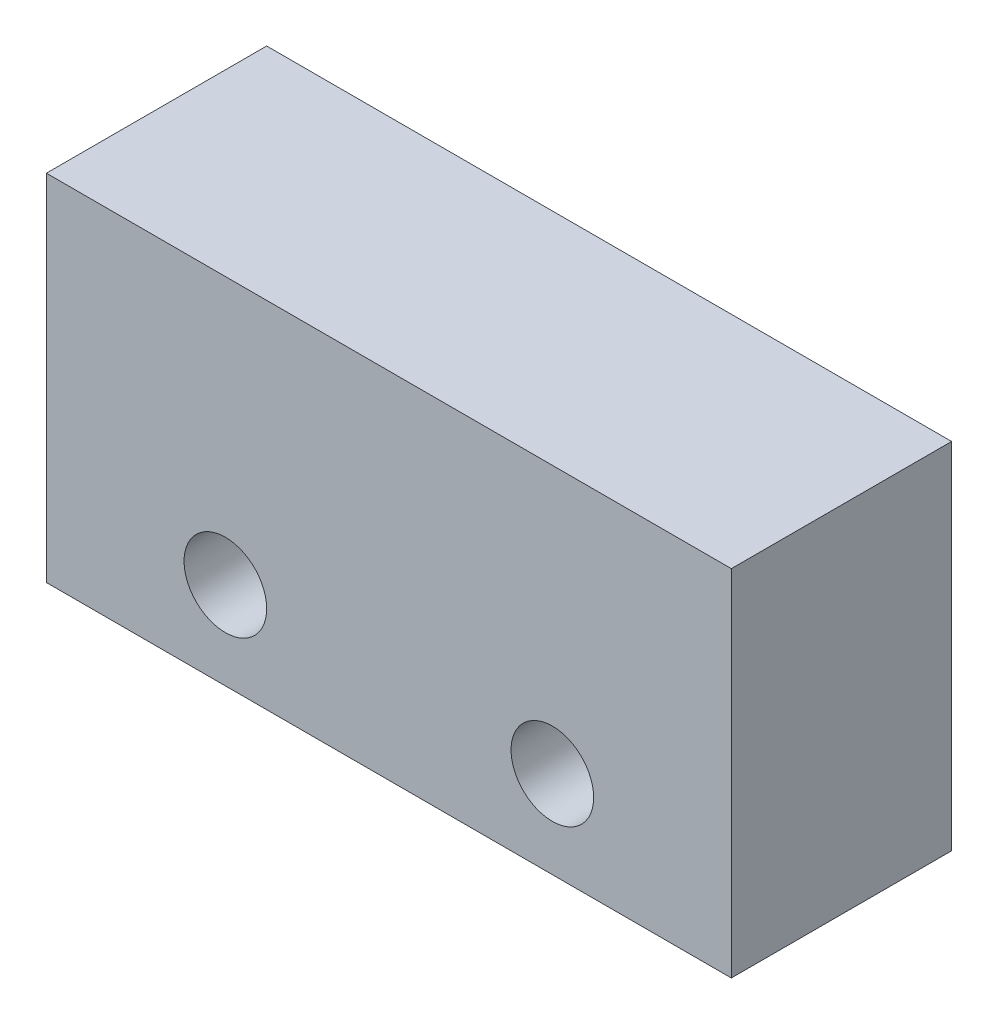
ISO-10303-21;
HEADER;
FILE_DESCRIPTION(('STEP AP214'),'2;1');
FILE_NAME('part.step','',(''),(''),'','','');
FILE_SCHEMA(('AUTOMOTIVE_DESIGN { 1 0 10303 214 1 1 1 1 }'));
ENDSEC;
DATA;
#1=APPLICATION_CONTEXT('core data for automotive mechanical design processes');
#2=APPLICATION_PROTOCOL_DEFINITION('international standard','automotive_design',2000,#1);
#3=PRODUCT_CONTEXT('',#1,'mechanical');
#4=PRODUCT('Part','Part','',(#3));
#5=PRODUCT_RELATED_PRODUCT_CATEGORY('part','',(#4));
#6=PRODUCT_DEFINITION_FORMATION('','',#4);
#7=PRODUCT_DEFINITION_CONTEXT('part definition',#1,'design');
#8=PRODUCT_DEFINITION('design','',#6,#7);
#9=PRODUCT_DEFINITION_SHAPE('','',#8);
#10=(LENGTH_UNIT() NAMED_UNIT(*) SI_UNIT(.MILLI.,.METRE.));
#11=(NAMED_UNIT(*) PLANE_ANGLE_UNIT() SI_UNIT($,.RADIAN.));
#12=(NAMED_UNIT(*) SI_UNIT($,.STERADIAN.) SOLID_ANGLE_UNIT());
#13=UNCERTAINTY_MEASURE_WITH_UNIT(LENGTH_MEASURE(1.E-05),#10,'distance_accuracy_value','');
#14=(GEOMETRIC_REPRESENTATION_CONTEXT(3) GLOBAL_UNCERTAINTY_ASSIGNED_CONTEXT((#13)) GLOBAL_UNIT_ASSIGNED_CONTEXT((#10,
#11,#12)) REPRESENTATION_CONTEXT('',''));
#15=CARTESIAN_POINT('',(0.,0.,0.));
#16=DIRECTION('',(0.,0.,1.));
#17=DIRECTION('',(1.,0.,0.));
#18=AXIS2_PLACEMENT_3D('',#15,#16,#17);
#19=CARTESIAN_POINT('',(0.,0.,6.4));
#20=DIRECTION('',(0.,0.,1.));
#21=DIRECTION('',(1.,0.,0.));
#22=AXIS2_PLACEMENT_3D('',#19,#20,#21);
#23=PLANE('',#22);
#24=CARTESIAN_POINT('',(-4.75,-2.61,6.4));
#25=DIRECTION('',(0.,0.,1.));
#26=DIRECTION('',(1.,0.,0.));
#27=AXIS2_PLACEMENT_3D('',#24,#25,#26);
#28=CIRCLE('',#27,1.2);
#29=CARTESIAN_POINT('',(-3.55,-2.61,6.4));
#30=VERTEX_POINT('',#29);
#31=EDGE_CURVE('E116',#30,#30,#28,.T.);
#32=ORIENTED_EDGE('',*,*,#31,.F.);
#33=EDGE_LOOP('',(#32));
#34=FACE_BOUND('',#33,.T.);
#35=DIRECTION('',(0.,-1.,0.));
#36=VECTOR('',#35,1.);
#37=CARTESIAN_POINT('',(-9.95,-5.15,6.4));
#38=LINE('',#37,#36);
#39=CARTESIAN_POINT('',(-9.95,5.15,6.4));
#40=VERTEX_POINT('',#39);
#41=CARTESIAN_POINT('',(-9.95,-5.15,6.4));
#42=VERTEX_POINT('',#41);
#43=EDGE_CURVE('E96',#40,#42,#38,.T.);
#44=ORIENTED_EDGE('',*,*,#43,.T.);
#45=DIRECTION('',(1.,0.,0.));
#46=VECTOR('',#45,1.);
#47=CARTESIAN_POINT('',(9.95,-5.15,6.4));
#48=LINE('',#47,#46);
#49=CARTESIAN_POINT('',(9.95,-5.15,6.4));
#50=VERTEX_POINT('',#49);
#51=EDGE_CURVE('E91',#42,#50,#48,.T.);
#52=ORIENTED_EDGE('',*,*,#51,.T.);
#53=DIRECTION('',(0.,1.,0.));
#54=VECTOR('',#53,1.);
#55=CARTESIAN_POINT('',(9.95,-5.15,6.4));
#56=LINE('',#55,#54);
#57=CARTESIAN_POINT('',(9.95,5.15,6.4));
#58=VERTEX_POINT('',#57);
#59=EDGE_CURVE('E94',#50,#58,#56,.T.);
#60=ORIENTED_EDGE('',*,*,#59,.T.);
#61=DIRECTION('',(-1.,0.,0.));
#62=VECTOR('',#61,1.);
#63=CARTESIAN_POINT('',(9.95,5.15,6.4));
#64=LINE('',#63,#62);
#65=EDGE_CURVE('E61',#58,#40,#64,.T.);
#66=ORIENTED_EDGE('',*,*,#65,.T.);
#67=EDGE_LOOP('',(#44,#52,#60,#66));
#68=FACE_BOUND('',#67,.T.);
#69=CARTESIAN_POINT('',(4.75,-2.61,6.4));
#70=DIRECTION('',(0.,0.,1.));
#71=DIRECTION('',(1.,0.,0.));
#72=AXIS2_PLACEMENT_3D('',#69,#70,#71);
#73=CIRCLE('',#72,1.2);
#74=CARTESIAN_POINT('',(5.95,-2.61,6.4));
#75=VERTEX_POINT('',#74);
#76=EDGE_CURVE('E138',#75,#75,#73,.T.);
#77=ORIENTED_EDGE('',*,*,#76,.F.);
#78=EDGE_LOOP('',(#77));
#79=FACE_BOUND('',#78,.T.);
#80=ADVANCED_FACE('F43',(#34,#68,#79),#23,.T.);
#81=CARTESIAN_POINT('',(0.,0.,0.));
#82=DIRECTION('',(0.,0.,1.));
#83=DIRECTION('',(1.,0.,0.));
#84=AXIS2_PLACEMENT_3D('',#81,#82,#83);
#85=PLANE('',#84);
#86=DIRECTION('',(0.,-1.,0.));
#87=VECTOR('',#86,1.);
#88=CARTESIAN_POINT('',(-9.95,-5.15,0.));
#89=LINE('',#88,#87);
#90=CARTESIAN_POINT('',(-9.95,5.15,0.));
#91=VERTEX_POINT('',#90);
#92=CARTESIAN_POINT('',(-9.95,-5.15,0.));
#93=VERTEX_POINT('',#92);
#94=EDGE_CURVE('E112',#91,#93,#89,.T.);
#95=ORIENTED_EDGE('',*,*,#94,.F.);
#96=DIRECTION('',(-1.,0.,0.));
#97=VECTOR('',#96,1.);
#98=CARTESIAN_POINT('',(9.95,5.15,0.));
#99=LINE('',#98,#97);
#100=CARTESIAN_POINT('',(9.95,5.15,0.));
#101=VERTEX_POINT('',#100);
#102=EDGE_CURVE('E84',#101,#91,#99,.T.);
#103=ORIENTED_EDGE('',*,*,#102,.F.);
#104=DIRECTION('',(0.,1.,0.));
#105=VECTOR('',#104,1.);
#106=CARTESIAN_POINT('',(9.95,-5.15,0.));
#107=LINE('',#106,#105);
#108=CARTESIAN_POINT('',(9.95,-5.15,0.));
#109=VERTEX_POINT('',#108);
#110=EDGE_CURVE('E78',#109,#101,#107,.T.);
#111=ORIENTED_EDGE('',*,*,#110,.F.);
#112=DIRECTION('',(1.,0.,0.));
#113=VECTOR('',#112,1.);
#114=CARTESIAN_POINT('',(9.95,-5.15,0.));
#115=LINE('',#114,#113);
#116=EDGE_CURVE('E101',#93,#109,#115,.T.);
#117=ORIENTED_EDGE('',*,*,#116,.F.);
#118=EDGE_LOOP('',(#95,#103,#111,#117));
#119=FACE_BOUND('',#118,.T.);
#120=CARTESIAN_POINT('',(-4.75,-2.61,0.));
#121=DIRECTION('',(0.,0.,1.));
#122=DIRECTION('',(1.,0.,0.));
#123=AXIS2_PLACEMENT_3D('',#120,#121,#122);
#124=CIRCLE('',#123,1.2);
#125=CARTESIAN_POINT('',(-3.55,-2.61,0.));
#126=VERTEX_POINT('',#125);
#127=EDGE_CURVE('E134',#126,#126,#124,.T.);
#128=ORIENTED_EDGE('',*,*,#127,.T.);
#129=EDGE_LOOP('',(#128));
#130=FACE_BOUND('',#129,.T.);
#131=CARTESIAN_POINT('',(4.75,-2.61,0.));
#132=DIRECTION('',(0.,0.,1.));
#133=DIRECTION('',(1.,0.,0.));
#134=AXIS2_PLACEMENT_3D('',#131,#132,#133);
#135=CIRCLE('',#134,1.2);
#136=CARTESIAN_POINT('',(5.95,-2.61,0.));
#137=VERTEX_POINT('',#136);
#138=EDGE_CURVE('E142',#137,#137,#135,.T.);
#139=ORIENTED_EDGE('',*,*,#138,.T.);
#140=EDGE_LOOP('',(#139));
#141=FACE_BOUND('',#140,.T.);
#142=ADVANCED_FACE('F129',(#119,#130,#141),#85,.F.);
#143=CARTESIAN_POINT('',(-9.95,-5.15,6.4));
#144=DIRECTION('',(1.,0.,0.));
#145=DIRECTION('',(0.,0.,-1.));
#146=AXIS2_PLACEMENT_3D('',#143,#144,#145);
#147=PLANE('',#146);
#148=ORIENTED_EDGE('',*,*,#94,.T.);
#149=DIRECTION('',(0.,0.,-1.));
#150=VECTOR('',#149,1.);
#151=CARTESIAN_POINT('',(-9.95,-5.15,6.4));
#152=LINE('',#151,#150);
#153=EDGE_CURVE('E11',#42,#93,#152,.T.);
#154=ORIENTED_EDGE('',*,*,#153,.F.);
#155=ORIENTED_EDGE('',*,*,#43,.F.);
#156=DIRECTION('',(0.,0.,-1.));
#157=VECTOR('',#156,1.);
#158=CARTESIAN_POINT('',(-9.95,5.15,6.4));
#159=LINE('',#158,#157);
#160=EDGE_CURVE('E108',#40,#91,#159,.T.);
#161=ORIENTED_EDGE('',*,*,#160,.T.);
#162=EDGE_LOOP('',(#148,#154,#155,#161));
#163=FACE_BOUND('',#162,.T.);
#164=ADVANCED_FACE('F45',(#163),#147,.F.);
#165=CARTESIAN_POINT('',(9.95,-5.15,6.4));
#166=DIRECTION('',(0.,1.,0.));
#167=DIRECTION('',(-1.,0.,0.));
#168=AXIS2_PLACEMENT_3D('',#165,#166,#167);
#169=PLANE('',#168);
#170=ORIENTED_EDGE('',*,*,#116,.T.);
#171=DIRECTION('',(0.,0.,-1.));
#172=VECTOR('',#171,1.);
#173=CARTESIAN_POINT('',(9.95,-5.15,6.4));
#174=LINE('',#173,#172);
#175=EDGE_CURVE('E53',#50,#109,#174,.T.);
#176=ORIENTED_EDGE('',*,*,#175,.F.);
#177=ORIENTED_EDGE('',*,*,#51,.F.);
#178=ORIENTED_EDGE('',*,*,#153,.T.);
#179=EDGE_LOOP('',(#170,#176,#177,#178));
#180=FACE_BOUND('',#179,.T.);
#181=ADVANCED_FACE('F100',(#180),#169,.F.);
#182=CARTESIAN_POINT('',(9.95,-5.15,6.4));
#183=DIRECTION('',(-1.,0.,0.));
#184=DIRECTION('',(0.,0.,1.));
#185=AXIS2_PLACEMENT_3D('',#182,#183,#184);
#186=PLANE('',#185);
#187=ORIENTED_EDGE('',*,*,#110,.T.);
#188=DIRECTION('',(0.,0.,-1.));
#189=VECTOR('',#188,1.);
#190=CARTESIAN_POINT('',(9.95,5.15,6.4));
#191=LINE('',#190,#189);
#192=EDGE_CURVE('E103',#58,#101,#191,.T.);
#193=ORIENTED_EDGE('',*,*,#192,.F.);
#194=ORIENTED_EDGE('',*,*,#59,.F.);
#195=ORIENTED_EDGE('',*,*,#175,.T.);
#196=EDGE_LOOP('',(#187,#193,#194,#195));
#197=FACE_BOUND('',#196,.T.);
#198=ADVANCED_FACE('F104',(#197),#186,.F.);
#199=CARTESIAN_POINT('',(9.95,5.15,6.4));
#200=DIRECTION('',(0.,-1.,0.));
#201=DIRECTION('',(1.,0.,0.));
#202=AXIS2_PLACEMENT_3D('',#199,#200,#201);
#203=PLANE('',#202);
#204=ORIENTED_EDGE('',*,*,#102,.T.);
#205=ORIENTED_EDGE('',*,*,#160,.F.);
#206=ORIENTED_EDGE('',*,*,#65,.F.);
#207=ORIENTED_EDGE('',*,*,#192,.T.);
#208=EDGE_LOOP('',(#204,#205,#206,#207));
#209=FACE_BOUND('',#208,.T.);
#210=ADVANCED_FACE('F126',(#209),#203,.F.);
#211=CARTESIAN_POINT('',(-4.75,-2.61,6.4));
#212=DIRECTION('',(0.,0.,-1.));
#213=DIRECTION('',(-1.,0.,0.));
#214=AXIS2_PLACEMENT_3D('',#211,#212,#213);
#215=CYLINDRICAL_SURFACE('',#214,1.2);
#216=ORIENTED_EDGE('',*,*,#31,.T.);
#217=EDGE_LOOP('',(#216));
#218=FACE_BOUND('',#217,.T.);
#219=ORIENTED_EDGE('',*,*,#127,.F.);
#220=EDGE_LOOP('',(#219));
#221=FACE_BOUND('',#220,.T.);
#222=ADVANCED_FACE('F161',(#218,#221),#215,.F.);
#223=CARTESIAN_POINT('',(4.75,-2.61,6.4));
#224=DIRECTION('',(0.,0.,-1.));
#225=DIRECTION('',(-1.,0.,0.));
#226=AXIS2_PLACEMENT_3D('',#223,#224,#225);
#227=CYLINDRICAL_SURFACE('',#226,1.2);
#228=ORIENTED_EDGE('',*,*,#76,.T.);
#229=EDGE_LOOP('',(#228));
#230=FACE_BOUND('',#229,.T.);
#231=ORIENTED_EDGE('',*,*,#138,.F.);
#232=EDGE_LOOP('',(#231));
#233=FACE_BOUND('',#232,.T.);
#234=ADVANCED_FACE('F150',(#230,#233),#227,.F.);
#235=CLOSED_SHELL('',(#80,#142,#164,#181,#198,#210,#222,#234));
#236=MANIFOLD_SOLID_BREP('B2',#235);
#237=ADVANCED_BREP_SHAPE_REPRESENTATION('',(#18,#236),#14);
#238=SHAPE_DEFINITION_REPRESENTATION(#9,#237);
ENDSEC;
END-ISO-10303-21;
